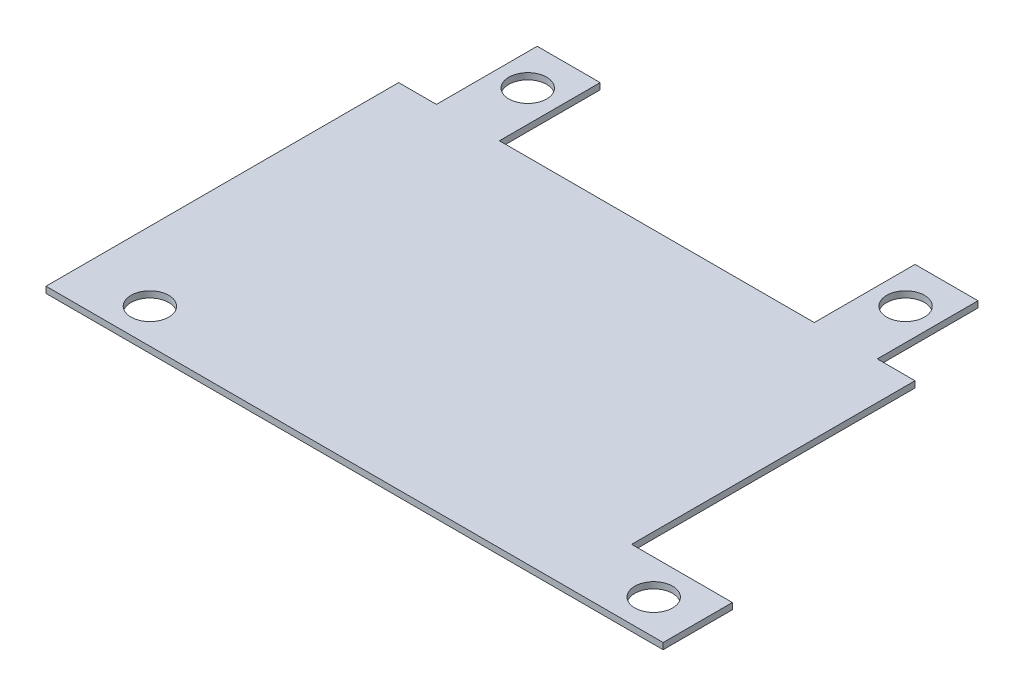
ISO-10303-21;
HEADER;
FILE_DESCRIPTION(('STEP AP214'),'2;1');
FILE_NAME('part.step','',(''),(''),'','','');
FILE_SCHEMA(('AUTOMOTIVE_DESIGN { 1 0 10303 214 1 1 1 1 }'));
ENDSEC;
DATA;
#1=APPLICATION_CONTEXT('core data for automotive mechanical design processes');
#2=APPLICATION_PROTOCOL_DEFINITION('international standard','automotive_design',2000,#1);
#3=PRODUCT_CONTEXT('',#1,'mechanical');
#4=PRODUCT('Part','Part','',(#3));
#5=PRODUCT_RELATED_PRODUCT_CATEGORY('part','',(#4));
#6=PRODUCT_DEFINITION_FORMATION('','',#4);
#7=PRODUCT_DEFINITION_CONTEXT('part definition',#1,'design');
#8=PRODUCT_DEFINITION('design','',#6,#7);
#9=PRODUCT_DEFINITION_SHAPE('','',#8);
#10=(LENGTH_UNIT() NAMED_UNIT(*) SI_UNIT(.MILLI.,.METRE.));
#11=(NAMED_UNIT(*) PLANE_ANGLE_UNIT() SI_UNIT($,.RADIAN.));
#12=(NAMED_UNIT(*) SI_UNIT($,.STERADIAN.) SOLID_ANGLE_UNIT());
#13=UNCERTAINTY_MEASURE_WITH_UNIT(LENGTH_MEASURE(1.E-05),#10,'distance_accuracy_value','');
#14=(GEOMETRIC_REPRESENTATION_CONTEXT(3) GLOBAL_UNCERTAINTY_ASSIGNED_CONTEXT((#13)) GLOBAL_UNIT_ASSIGNED_CONTEXT((#10,
#11,#12)) REPRESENTATION_CONTEXT('',''));
#15=CARTESIAN_POINT('',(0.,0.,0.));
#16=DIRECTION('',(0.,0.,1.));
#17=DIRECTION('',(1.,0.,0.));
#18=AXIS2_PLACEMENT_3D('',#15,#16,#17);
#19=CARTESIAN_POINT('',(20.5,0.5,-14.));
#20=DIRECTION('',(0.,0.,1.));
#21=DIRECTION('',(1.,0.,0.));
#22=AXIS2_PLACEMENT_3D('',#19,#20,#21);
#23=PLANE('',#22);
#24=DIRECTION('',(0.,-1.,0.));
#25=VECTOR('',#24,1.);
#26=CARTESIAN_POINT('',(12.5,10.2082439194738,-14.));
#27=LINE('',#26,#25);
#28=CARTESIAN_POINT('',(12.5,0.5,-14.));
#29=VERTEX_POINT('',#28);
#30=CARTESIAN_POINT('',(12.5,0.,-14.));
#31=VERTEX_POINT('',#30);
#32=EDGE_CURVE('E188',#29,#31,#27,.T.);
#33=ORIENTED_EDGE('',*,*,#32,.T.);
#34=DIRECTION('',(-1.,0.,0.));
#35=VECTOR('',#34,1.);
#36=CARTESIAN_POINT('',(20.5,0.,-14.));
#37=LINE('',#36,#35);
#38=CARTESIAN_POINT('',(-12.5,0.,-14.));
#39=VERTEX_POINT('',#38);
#40=EDGE_CURVE('E247',#31,#39,#37,.T.);
#41=ORIENTED_EDGE('',*,*,#40,.T.);
#42=DIRECTION('',(0.,-1.,0.));
#43=VECTOR('',#42,1.);
#44=CARTESIAN_POINT('',(-12.5,10.2082439194738,-14.));
#45=LINE('',#44,#43);
#46=CARTESIAN_POINT('',(-12.5,0.5,-14.));
#47=VERTEX_POINT('',#46);
#48=EDGE_CURVE('E234',#47,#39,#45,.T.);
#49=ORIENTED_EDGE('',*,*,#48,.F.);
#50=DIRECTION('',(-1.,0.,0.));
#51=VECTOR('',#50,1.);
#52=CARTESIAN_POINT('',(20.5,0.5,-14.));
#53=LINE('',#52,#51);
#54=EDGE_CURVE('E60',#29,#47,#53,.T.);
#55=ORIENTED_EDGE('',*,*,#54,.F.);
#56=EDGE_LOOP('',(#33,#41,#49,#55));
#57=FACE_BOUND('',#56,.T.);
#58=ADVANCED_FACE('F35',(#57),#23,.F.);
#59=DIRECTION('',(0.,-1.,0.));
#60=VECTOR('',#59,1.);
#61=CARTESIAN_POINT('',(17.5,10.2082439194738,-14.));
#62=LINE('',#61,#60);
#63=CARTESIAN_POINT('',(17.5,0.5,-14.));
#64=VERTEX_POINT('',#63);
#65=CARTESIAN_POINT('',(17.5,0.,-14.));
#66=VERTEX_POINT('',#65);
#67=EDGE_CURVE('E184',#64,#66,#62,.T.);
#68=ORIENTED_EDGE('',*,*,#67,.F.);
#69=CARTESIAN_POINT('',(20.5,0.5,-14.));
#70=VERTEX_POINT('',#69);
#71=EDGE_CURVE('E272',#70,#64,#53,.T.);
#72=ORIENTED_EDGE('',*,*,#71,.F.);
#73=DIRECTION('',(0.,-1.,0.));
#74=VECTOR('',#73,1.);
#75=CARTESIAN_POINT('',(20.5,0.5,-14.));
#76=LINE('',#75,#74);
#77=CARTESIAN_POINT('',(20.5,0.,-14.));
#78=VERTEX_POINT('',#77);
#79=EDGE_CURVE('E44',#70,#78,#76,.T.);
#80=ORIENTED_EDGE('',*,*,#79,.T.);
#81=EDGE_CURVE('E250',#78,#66,#37,.T.);
#82=ORIENTED_EDGE('',*,*,#81,.T.);
#83=EDGE_LOOP('',(#68,#72,#80,#82));
#84=FACE_BOUND('',#83,.T.);
#85=ADVANCED_FACE('F357',(#84),#23,.F.);
#86=CARTESIAN_POINT('',(-20.5,0.5,-14.));
#87=DIRECTION('',(1.,0.,0.));
#88=DIRECTION('',(0.,0.,-1.));
#89=AXIS2_PLACEMENT_3D('',#86,#87,#88);
#90=PLANE('',#89);
#91=DIRECTION('',(0.,0.,1.));
#92=VECTOR('',#91,1.);
#93=CARTESIAN_POINT('',(-20.5,0.,-14.));
#94=LINE('',#93,#92);
#95=CARTESIAN_POINT('',(-20.5,0.,-14.));
#96=VERTEX_POINT('',#95);
#97=CARTESIAN_POINT('',(-20.5,0.,14.));
#98=VERTEX_POINT('',#97);
#99=EDGE_CURVE('E284',#96,#98,#94,.T.);
#100=ORIENTED_EDGE('',*,*,#99,.T.);
#101=DIRECTION('',(0.,-1.,0.));
#102=VECTOR('',#101,1.);
#103=CARTESIAN_POINT('',(-20.5,0.5,14.));
#104=LINE('',#103,#102);
#105=CARTESIAN_POINT('',(-20.5,0.5,14.));
#106=VERTEX_POINT('',#105);
#107=EDGE_CURVE('E11',#106,#98,#104,.T.);
#108=ORIENTED_EDGE('',*,*,#107,.F.);
#109=DIRECTION('',(0.,0.,1.));
#110=VECTOR('',#109,1.);
#111=CARTESIAN_POINT('',(-20.5,0.5,-14.));
#112=LINE('',#111,#110);
#113=CARTESIAN_POINT('',(-20.5,0.5,-14.));
#114=VERTEX_POINT('',#113);
#115=EDGE_CURVE('E146',#114,#106,#112,.T.);
#116=ORIENTED_EDGE('',*,*,#115,.F.);
#117=DIRECTION('',(0.,-1.,0.));
#118=VECTOR('',#117,1.);
#119=CARTESIAN_POINT('',(-20.5,0.5,-14.));
#120=LINE('',#119,#118);
#121=EDGE_CURVE('E259',#114,#96,#120,.T.);
#122=ORIENTED_EDGE('',*,*,#121,.T.);
#123=EDGE_LOOP('',(#100,#108,#116,#122));
#124=FACE_BOUND('',#123,.T.);
#125=ADVANCED_FACE('F37',(#124),#90,.F.);
#126=CARTESIAN_POINT('',(20.5,0.5,14.));
#127=DIRECTION('',(0.,0.,-1.));
#128=DIRECTION('',(-1.,0.,0.));
#129=AXIS2_PLACEMENT_3D('',#126,#127,#128);
#130=PLANE('',#129);
#131=DIRECTION('',(1.,0.,0.));
#132=VECTOR('',#131,1.);
#133=CARTESIAN_POINT('',(20.5,0.,14.));
#134=LINE('',#133,#132);
#135=CARTESIAN_POINT('',(28.5,0.,14.));
#136=VERTEX_POINT('',#135);
#137=EDGE_CURVE('E154',#98,#136,#134,.T.);
#138=ORIENTED_EDGE('',*,*,#137,.T.);
#139=DIRECTION('',(0.,-1.,0.));
#140=VECTOR('',#139,1.);
#141=CARTESIAN_POINT('',(28.5,10.2082439194738,14.));
#142=LINE('',#141,#140);
#143=CARTESIAN_POINT('',(28.5,0.5,14.));
#144=VERTEX_POINT('',#143);
#145=EDGE_CURVE('E152',#144,#136,#142,.T.);
#146=ORIENTED_EDGE('',*,*,#145,.F.);
#147=DIRECTION('',(1.,0.,0.));
#148=VECTOR('',#147,1.);
#149=CARTESIAN_POINT('',(20.5,0.5,14.));
#150=LINE('',#149,#148);
#151=EDGE_CURVE('E139',#106,#144,#150,.T.);
#152=ORIENTED_EDGE('',*,*,#151,.F.);
#153=ORIENTED_EDGE('',*,*,#107,.T.);
#154=EDGE_LOOP('',(#138,#146,#152,#153));
#155=FACE_BOUND('',#154,.T.);
#156=ADVANCED_FACE('F153',(#155),#130,.F.);
#157=CARTESIAN_POINT('',(20.5,0.5,-14.));
#158=DIRECTION('',(-1.,0.,0.));
#159=DIRECTION('',(0.,0.,1.));
#160=AXIS2_PLACEMENT_3D('',#157,#158,#159);
#161=PLANE('',#160);
#162=DIRECTION('',(0.,0.,-1.));
#163=VECTOR('',#162,1.);
#164=CARTESIAN_POINT('',(20.5,0.5,-14.));
#165=LINE('',#164,#163);
#166=CARTESIAN_POINT('',(20.5,0.5,8.50000000000001));
#167=VERTEX_POINT('',#166);
#168=EDGE_CURVE('E149',#167,#70,#165,.T.);
#169=ORIENTED_EDGE('',*,*,#168,.F.);
#170=DIRECTION('',(0.,-1.,0.));
#171=VECTOR('',#170,1.);
#172=CARTESIAN_POINT('',(20.5,10.2082439194738,8.50000000000001));
#173=LINE('',#172,#171);
#174=CARTESIAN_POINT('',(20.5,0.,8.50000000000001));
#175=VERTEX_POINT('',#174);
#176=EDGE_CURVE('E163',#167,#175,#173,.T.);
#177=ORIENTED_EDGE('',*,*,#176,.T.);
#178=DIRECTION('',(0.,0.,-1.));
#179=VECTOR('',#178,1.);
#180=CARTESIAN_POINT('',(20.5,0.,-14.));
#181=LINE('',#180,#179);
#182=EDGE_CURVE('E287',#175,#78,#181,.T.);
#183=ORIENTED_EDGE('',*,*,#182,.T.);
#184=ORIENTED_EDGE('',*,*,#79,.F.);
#185=EDGE_LOOP('',(#169,#177,#183,#184));
#186=FACE_BOUND('',#185,.T.);
#187=ADVANCED_FACE('F367',(#186),#161,.F.);
#188=CARTESIAN_POINT('',(-17.5,0.5,-14.));
#189=VERTEX_POINT('',#188);
#190=EDGE_CURVE('E278',#189,#114,#53,.T.);
#191=ORIENTED_EDGE('',*,*,#190,.F.);
#192=DIRECTION('',(0.,-1.,0.));
#193=VECTOR('',#192,1.);
#194=CARTESIAN_POINT('',(-17.5,10.2082439194738,-14.));
#195=LINE('',#194,#193);
#196=CARTESIAN_POINT('',(-17.5,0.,-14.));
#197=VERTEX_POINT('',#196);
#198=EDGE_CURVE('E221',#189,#197,#195,.T.);
#199=ORIENTED_EDGE('',*,*,#198,.T.);
#200=EDGE_CURVE('E251',#197,#96,#37,.T.);
#201=ORIENTED_EDGE('',*,*,#200,.T.);
#202=ORIENTED_EDGE('',*,*,#121,.F.);
#203=EDGE_LOOP('',(#191,#199,#201,#202));
#204=FACE_BOUND('',#203,.T.);
#205=ADVANCED_FACE('F315',(#204),#23,.F.);
#206=CARTESIAN_POINT('',(0.,0.5,0.));
#207=DIRECTION('',(0.,-1.,0.));
#208=DIRECTION('',(0.,0.,-1.));
#209=AXIS2_PLACEMENT_3D('',#206,#207,#208);
#210=PLANE('',#209);
#211=CARTESIAN_POINT('',(-15.,0.5,11.25));
#212=DIRECTION('',(0.,1.,0.));
#213=DIRECTION('',(0.,0.,1.));
#214=AXIS2_PLACEMENT_3D('',#211,#212,#213);
#215=CIRCLE('',#214,1.5);
#216=CARTESIAN_POINT('',(-15.,0.5,12.75));
#217=VERTEX_POINT('',#216);
#218=EDGE_CURVE('E300',#217,#217,#215,.T.);
#219=ORIENTED_EDGE('',*,*,#218,.F.);
#220=EDGE_LOOP('',(#219));
#221=FACE_BOUND('',#220,.T.);
#222=CARTESIAN_POINT('',(25.,0.5,11.25));
#223=DIRECTION('',(0.,-1.,0.));
#224=DIRECTION('',(0.,0.,-1.));
#225=AXIS2_PLACEMENT_3D('',#222,#223,#224);
#226=CIRCLE('',#225,1.5);
#227=CARTESIAN_POINT('',(25.,0.5,9.75));
#228=VERTEX_POINT('',#227);
#229=EDGE_CURVE('E171',#228,#228,#226,.T.);
#230=ORIENTED_EDGE('',*,*,#229,.T.);
#231=EDGE_LOOP('',(#230));
#232=FACE_BOUND('',#231,.T.);
#233=CARTESIAN_POINT('',(15.,0.5,-18.75));
#234=DIRECTION('',(0.,-1.,0.));
#235=DIRECTION('',(0.,0.,-1.));
#236=AXIS2_PLACEMENT_3D('',#233,#234,#235);
#237=CIRCLE('',#236,1.5);
#238=CARTESIAN_POINT('',(15.,0.5,-20.25));
#239=VERTEX_POINT('',#238);
#240=EDGE_CURVE('E178',#239,#239,#237,.T.);
#241=ORIENTED_EDGE('',*,*,#240,.T.);
#242=EDGE_LOOP('',(#241));
#243=FACE_BOUND('',#242,.T.);
#244=CARTESIAN_POINT('',(-15.,0.5,-18.75));
#245=DIRECTION('',(0.,-1.,0.));
#246=DIRECTION('',(0.,0.,-1.));
#247=AXIS2_PLACEMENT_3D('',#244,#245,#246);
#248=CIRCLE('',#247,1.5);
#249=CARTESIAN_POINT('',(-15.,0.5,-20.25));
#250=VERTEX_POINT('',#249);
#251=EDGE_CURVE('E211',#250,#250,#248,.T.);
#252=ORIENTED_EDGE('',*,*,#251,.T.);
#253=EDGE_LOOP('',(#252));
#254=FACE_BOUND('',#253,.T.);
#255=ORIENTED_EDGE('',*,*,#115,.T.);
#256=ORIENTED_EDGE('',*,*,#151,.T.);
#257=DIRECTION('',(0.,0.,1.));
#258=VECTOR('',#257,1.);
#259=CARTESIAN_POINT('',(28.5,0.5,14.));
#260=LINE('',#259,#258);
#261=CARTESIAN_POINT('',(28.5,0.5,8.50000000000001));
#262=VERTEX_POINT('',#261);
#263=EDGE_CURVE('E143',#262,#144,#260,.T.);
#264=ORIENTED_EDGE('',*,*,#263,.F.);
#265=DIRECTION('',(1.,0.,0.));
#266=VECTOR('',#265,1.);
#267=CARTESIAN_POINT('',(20.5,0.5,8.50000000000001));
#268=LINE('',#267,#266);
#269=EDGE_CURVE('E295',#167,#262,#268,.T.);
#270=ORIENTED_EDGE('',*,*,#269,.F.);
#271=ORIENTED_EDGE('',*,*,#168,.T.);
#272=ORIENTED_EDGE('',*,*,#71,.T.);
#273=DIRECTION('',(0.,0.,1.));
#274=VECTOR('',#273,1.);
#275=CARTESIAN_POINT('',(17.5,0.5,-14.));
#276=LINE('',#275,#274);
#277=CARTESIAN_POINT('',(17.5,0.5,-22.));
#278=VERTEX_POINT('',#277);
#279=EDGE_CURVE('E194',#278,#64,#276,.T.);
#280=ORIENTED_EDGE('',*,*,#279,.F.);
#281=DIRECTION('',(1.,0.,0.));
#282=VECTOR('',#281,1.);
#283=CARTESIAN_POINT('',(12.5,0.5,-22.));
#284=LINE('',#283,#282);
#285=CARTESIAN_POINT('',(12.5,0.5,-22.));
#286=VERTEX_POINT('',#285);
#287=EDGE_CURVE('E183',#286,#278,#284,.T.);
#288=ORIENTED_EDGE('',*,*,#287,.F.);
#289=DIRECTION('',(0.,0.,-1.));
#290=VECTOR('',#289,1.);
#291=CARTESIAN_POINT('',(12.5,0.5,-14.));
#292=LINE('',#291,#290);
#293=EDGE_CURVE('E192',#29,#286,#292,.T.);
#294=ORIENTED_EDGE('',*,*,#293,.F.);
#295=ORIENTED_EDGE('',*,*,#54,.T.);
#296=DIRECTION('',(0.,0.,1.));
#297=VECTOR('',#296,1.);
#298=CARTESIAN_POINT('',(-12.5,0.5,-14.));
#299=LINE('',#298,#297);
#300=CARTESIAN_POINT('',(-12.5,0.5,-22.));
#301=VERTEX_POINT('',#300);
#302=EDGE_CURVE('E225',#301,#47,#299,.T.);
#303=ORIENTED_EDGE('',*,*,#302,.F.);
#304=DIRECTION('',(1.,0.,0.));
#305=VECTOR('',#304,1.);
#306=CARTESIAN_POINT('',(-17.5,0.5,-22.));
#307=LINE('',#306,#305);
#308=CARTESIAN_POINT('',(-17.5,0.5,-22.));
#309=VERTEX_POINT('',#308);
#310=EDGE_CURVE('E244',#309,#301,#307,.T.);
#311=ORIENTED_EDGE('',*,*,#310,.F.);
#312=DIRECTION('',(0.,0.,-1.));
#313=VECTOR('',#312,1.);
#314=CARTESIAN_POINT('',(-17.5,0.5,-14.));
#315=LINE('',#314,#313);
#316=EDGE_CURVE('E215',#189,#309,#315,.T.);
#317=ORIENTED_EDGE('',*,*,#316,.F.);
#318=ORIENTED_EDGE('',*,*,#190,.T.);
#319=EDGE_LOOP('',(#255,#256,#264,#270,#271,#272,#280,#288,#294,#295,#303,#311,#317,#318));
#320=FACE_BOUND('',#319,.T.);
#321=ADVANCED_FACE('F141',(#221,#232,#243,#254,#320),#210,.F.);
#322=CARTESIAN_POINT('',(0.,0.,0.));
#323=DIRECTION('',(0.,-1.,0.));
#324=DIRECTION('',(0.,0.,-1.));
#325=AXIS2_PLACEMENT_3D('',#322,#323,#324);
#326=PLANE('',#325);
#327=CARTESIAN_POINT('',(-15.,0.,11.25));
#328=DIRECTION('',(0.,-1.,0.));
#329=DIRECTION('',(0.,0.,-1.));
#330=AXIS2_PLACEMENT_3D('',#327,#328,#329);
#331=CIRCLE('',#330,1.5);
#332=CARTESIAN_POINT('',(-15.,0.,9.75000000000001));
#333=VERTEX_POINT('',#332);
#334=EDGE_CURVE('E39',#333,#333,#331,.T.);
#335=ORIENTED_EDGE('',*,*,#334,.F.);
#336=EDGE_LOOP('',(#335));
#337=FACE_BOUND('',#336,.T.);
#338=CARTESIAN_POINT('',(25.,0.,11.25));
#339=DIRECTION('',(0.,1.,0.));
#340=DIRECTION('',(0.,0.,1.));
#341=AXIS2_PLACEMENT_3D('',#338,#339,#340);
#342=CIRCLE('',#341,1.5);
#343=CARTESIAN_POINT('',(25.,0.,12.75));
#344=VERTEX_POINT('',#343);
#345=EDGE_CURVE('E165',#344,#344,#342,.T.);
#346=ORIENTED_EDGE('',*,*,#345,.T.);
#347=EDGE_LOOP('',(#346));
#348=FACE_BOUND('',#347,.T.);
#349=CARTESIAN_POINT('',(15.,0.,-18.75));
#350=DIRECTION('',(0.,1.,0.));
#351=DIRECTION('',(0.,0.,1.));
#352=AXIS2_PLACEMENT_3D('',#349,#350,#351);
#353=CIRCLE('',#352,1.5);
#354=CARTESIAN_POINT('',(15.,0.,-17.25));
#355=VERTEX_POINT('',#354);
#356=EDGE_CURVE('E174',#355,#355,#353,.T.);
#357=ORIENTED_EDGE('',*,*,#356,.T.);
#358=EDGE_LOOP('',(#357));
#359=FACE_BOUND('',#358,.T.);
#360=CARTESIAN_POINT('',(-15.,0.,-18.75));
#361=DIRECTION('',(0.,1.,0.));
#362=DIRECTION('',(0.,0.,1.));
#363=AXIS2_PLACEMENT_3D('',#360,#361,#362);
#364=CIRCLE('',#363,1.5);
#365=CARTESIAN_POINT('',(-15.,0.,-17.25));
#366=VERTEX_POINT('',#365);
#367=EDGE_CURVE('E207',#366,#366,#364,.T.);
#368=ORIENTED_EDGE('',*,*,#367,.T.);
#369=EDGE_LOOP('',(#368));
#370=FACE_BOUND('',#369,.T.);
#371=ORIENTED_EDGE('',*,*,#99,.F.);
#372=ORIENTED_EDGE('',*,*,#200,.F.);
#373=DIRECTION('',(0.,0.,1.));
#374=VECTOR('',#373,1.);
#375=CARTESIAN_POINT('',(-17.5,0.,-14.));
#376=LINE('',#375,#374);
#377=CARTESIAN_POINT('',(-17.5,0.,-22.));
#378=VERTEX_POINT('',#377);
#379=EDGE_CURVE('E226',#378,#197,#376,.T.);
#380=ORIENTED_EDGE('',*,*,#379,.F.);
#381=DIRECTION('',(-1.,0.,0.));
#382=VECTOR('',#381,1.);
#383=CARTESIAN_POINT('',(-17.5,0.,-22.));
#384=LINE('',#383,#382);
#385=CARTESIAN_POINT('',(-12.5,0.,-22.));
#386=VERTEX_POINT('',#385);
#387=EDGE_CURVE('E208',#386,#378,#384,.T.);
#388=ORIENTED_EDGE('',*,*,#387,.F.);
#389=DIRECTION('',(0.,0.,-1.));
#390=VECTOR('',#389,1.);
#391=CARTESIAN_POINT('',(-12.5,0.,-14.));
#392=LINE('',#391,#390);
#393=EDGE_CURVE('E237',#39,#386,#392,.T.);
#394=ORIENTED_EDGE('',*,*,#393,.F.);
#395=ORIENTED_EDGE('',*,*,#40,.F.);
#396=DIRECTION('',(0.,0.,1.));
#397=VECTOR('',#396,1.);
#398=CARTESIAN_POINT('',(12.5,0.,-14.));
#399=LINE('',#398,#397);
#400=CARTESIAN_POINT('',(12.5,0.,-22.));
#401=VERTEX_POINT('',#400);
#402=EDGE_CURVE('E185',#401,#31,#399,.T.);
#403=ORIENTED_EDGE('',*,*,#402,.F.);
#404=DIRECTION('',(-1.,0.,0.));
#405=VECTOR('',#404,1.);
#406=CARTESIAN_POINT('',(12.5,0.,-22.));
#407=LINE('',#406,#405);
#408=CARTESIAN_POINT('',(17.5,0.,-22.));
#409=VERTEX_POINT('',#408);
#410=EDGE_CURVE('E175',#409,#401,#407,.T.);
#411=ORIENTED_EDGE('',*,*,#410,.F.);
#412=DIRECTION('',(0.,0.,-1.));
#413=VECTOR('',#412,1.);
#414=CARTESIAN_POINT('',(17.5,0.,-14.));
#415=LINE('',#414,#413);
#416=EDGE_CURVE('E180',#66,#409,#415,.T.);
#417=ORIENTED_EDGE('',*,*,#416,.F.);
#418=ORIENTED_EDGE('',*,*,#81,.F.);
#419=ORIENTED_EDGE('',*,*,#182,.F.);
#420=DIRECTION('',(-1.,0.,0.));
#421=VECTOR('',#420,1.);
#422=CARTESIAN_POINT('',(20.5,0.,8.50000000000001));
#423=LINE('',#422,#421);
#424=CARTESIAN_POINT('',(28.5,0.,8.50000000000001));
#425=VERTEX_POINT('',#424);
#426=EDGE_CURVE('E52',#425,#175,#423,.T.);
#427=ORIENTED_EDGE('',*,*,#426,.F.);
#428=DIRECTION('',(0.,0.,-1.));
#429=VECTOR('',#428,1.);
#430=CARTESIAN_POINT('',(28.5,0.,14.));
#431=LINE('',#430,#429);
#432=EDGE_CURVE('E158',#136,#425,#431,.T.);
#433=ORIENTED_EDGE('',*,*,#432,.F.);
#434=ORIENTED_EDGE('',*,*,#137,.F.);
#435=EDGE_LOOP('',(#371,#372,#380,#388,#394,#395,#403,#411,#417,#418,#419,#427,#433,#434));
#436=FACE_BOUND('',#435,.T.);
#437=ADVANCED_FACE('F314',(#337,#348,#359,#370,#436),#326,.T.);
#438=CARTESIAN_POINT('',(-17.5,10.2082439194738,-14.));
#439=DIRECTION('',(1.,0.,0.));
#440=DIRECTION('',(0.,0.,-1.));
#441=AXIS2_PLACEMENT_3D('',#438,#439,#440);
#442=PLANE('',#441);
#443=ORIENTED_EDGE('',*,*,#198,.F.);
#444=ORIENTED_EDGE('',*,*,#316,.T.);
#445=DIRECTION('',(0.,-1.,0.));
#446=VECTOR('',#445,1.);
#447=CARTESIAN_POINT('',(-17.5,10.2082439194738,-22.));
#448=LINE('',#447,#446);
#449=EDGE_CURVE('E231',#309,#378,#448,.T.);
#450=ORIENTED_EDGE('',*,*,#449,.T.);
#451=ORIENTED_EDGE('',*,*,#379,.T.);
#452=EDGE_LOOP('',(#443,#444,#450,#451));
#453=FACE_BOUND('',#452,.T.);
#454=ADVANCED_FACE('F342',(#453),#442,.F.);
#455=CARTESIAN_POINT('',(-12.5,10.2082439194738,-14.));
#456=DIRECTION('',(-1.,0.,0.));
#457=DIRECTION('',(0.,0.,1.));
#458=AXIS2_PLACEMENT_3D('',#455,#456,#457);
#459=PLANE('',#458);
#460=DIRECTION('',(0.,-1.,0.));
#461=VECTOR('',#460,1.);
#462=CARTESIAN_POINT('',(-12.5,10.2082439194738,-22.));
#463=LINE('',#462,#461);
#464=EDGE_CURVE('E212',#301,#386,#463,.T.);
#465=ORIENTED_EDGE('',*,*,#464,.F.);
#466=ORIENTED_EDGE('',*,*,#302,.T.);
#467=ORIENTED_EDGE('',*,*,#48,.T.);
#468=ORIENTED_EDGE('',*,*,#393,.T.);
#469=EDGE_LOOP('',(#465,#466,#467,#468));
#470=FACE_BOUND('',#469,.T.);
#471=ADVANCED_FACE('F337',(#470),#459,.F.);
#472=CARTESIAN_POINT('',(-17.5,10.2082439194738,-22.));
#473=DIRECTION('',(0.,0.,1.));
#474=DIRECTION('',(1.,0.,0.));
#475=AXIS2_PLACEMENT_3D('',#472,#473,#474);
#476=PLANE('',#475);
#477=ORIENTED_EDGE('',*,*,#449,.F.);
#478=ORIENTED_EDGE('',*,*,#310,.T.);
#479=ORIENTED_EDGE('',*,*,#464,.T.);
#480=ORIENTED_EDGE('',*,*,#387,.T.);
#481=EDGE_LOOP('',(#477,#478,#479,#480));
#482=FACE_BOUND('',#481,.T.);
#483=ADVANCED_FACE('F332',(#482),#476,.F.);
#484=CARTESIAN_POINT('',(-15.,10.2082439194738,-18.75));
#485=DIRECTION('',(0.,-1.,0.));
#486=DIRECTION('',(0.,0.,-1.));
#487=AXIS2_PLACEMENT_3D('',#484,#485,#486);
#488=CYLINDRICAL_SURFACE('',#487,1.5);
#489=ORIENTED_EDGE('',*,*,#251,.F.);
#490=EDGE_LOOP('',(#489));
#491=FACE_BOUND('',#490,.T.);
#492=ORIENTED_EDGE('',*,*,#367,.F.);
#493=EDGE_LOOP('',(#492));
#494=FACE_BOUND('',#493,.T.);
#495=ADVANCED_FACE('F395',(#491,#494),#488,.F.);
#496=CARTESIAN_POINT('',(12.5,10.2082439194738,-14.));
#497=DIRECTION('',(1.,0.,0.));
#498=DIRECTION('',(0.,0.,-1.));
#499=AXIS2_PLACEMENT_3D('',#496,#497,#498);
#500=PLANE('',#499);
#501=ORIENTED_EDGE('',*,*,#32,.F.);
#502=ORIENTED_EDGE('',*,*,#293,.T.);
#503=DIRECTION('',(0.,-1.,0.));
#504=VECTOR('',#503,1.);
#505=CARTESIAN_POINT('',(12.5,10.2082439194738,-22.));
#506=LINE('',#505,#504);
#507=EDGE_CURVE('E189',#286,#401,#506,.T.);
#508=ORIENTED_EDGE('',*,*,#507,.T.);
#509=ORIENTED_EDGE('',*,*,#402,.T.);
#510=EDGE_LOOP('',(#501,#502,#508,#509));
#511=FACE_BOUND('',#510,.T.);
#512=ADVANCED_FACE('F350',(#511),#500,.F.);
#513=CARTESIAN_POINT('',(17.5,10.2082439194738,-14.));
#514=DIRECTION('',(-1.,0.,0.));
#515=DIRECTION('',(0.,0.,1.));
#516=AXIS2_PLACEMENT_3D('',#513,#514,#515);
#517=PLANE('',#516);
#518=DIRECTION('',(0.,-1.,0.));
#519=VECTOR('',#518,1.);
#520=CARTESIAN_POINT('',(17.5,10.2082439194738,-22.));
#521=LINE('',#520,#519);
#522=EDGE_CURVE('E179',#278,#409,#521,.T.);
#523=ORIENTED_EDGE('',*,*,#522,.F.);
#524=ORIENTED_EDGE('',*,*,#279,.T.);
#525=ORIENTED_EDGE('',*,*,#67,.T.);
#526=ORIENTED_EDGE('',*,*,#416,.T.);
#527=EDGE_LOOP('',(#523,#524,#525,#526));
#528=FACE_BOUND('',#527,.T.);
#529=ADVANCED_FACE('F356',(#528),#517,.F.);
#530=CARTESIAN_POINT('',(12.5,10.2082439194738,-22.));
#531=DIRECTION('',(0.,0.,1.));
#532=DIRECTION('',(1.,0.,0.));
#533=AXIS2_PLACEMENT_3D('',#530,#531,#532);
#534=PLANE('',#533);
#535=ORIENTED_EDGE('',*,*,#507,.F.);
#536=ORIENTED_EDGE('',*,*,#287,.T.);
#537=ORIENTED_EDGE('',*,*,#522,.T.);
#538=ORIENTED_EDGE('',*,*,#410,.T.);
#539=EDGE_LOOP('',(#535,#536,#537,#538));
#540=FACE_BOUND('',#539,.T.);
#541=ADVANCED_FACE('F353',(#540),#534,.F.);
#542=CARTESIAN_POINT('',(15.,10.2082439194738,-18.75));
#543=DIRECTION('',(0.,-1.,0.));
#544=DIRECTION('',(0.,0.,-1.));
#545=AXIS2_PLACEMENT_3D('',#542,#543,#544);
#546=CYLINDRICAL_SURFACE('',#545,1.5);
#547=ORIENTED_EDGE('',*,*,#240,.F.);
#548=EDGE_LOOP('',(#547));
#549=FACE_BOUND('',#548,.T.);
#550=ORIENTED_EDGE('',*,*,#356,.F.);
#551=EDGE_LOOP('',(#550));
#552=FACE_BOUND('',#551,.T.);
#553=ADVANCED_FACE('F385',(#549,#552),#546,.F.);
#554=CARTESIAN_POINT('',(28.5,10.2082439194738,14.));
#555=DIRECTION('',(-1.,0.,0.));
#556=DIRECTION('',(0.,0.,1.));
#557=AXIS2_PLACEMENT_3D('',#554,#555,#556);
#558=PLANE('',#557);
#559=DIRECTION('',(0.,-1.,0.));
#560=VECTOR('',#559,1.);
#561=CARTESIAN_POINT('',(28.5,10.2082439194738,8.50000000000001));
#562=LINE('',#561,#560);
#563=EDGE_CURVE('E161',#262,#425,#562,.T.);
#564=ORIENTED_EDGE('',*,*,#563,.F.);
#565=ORIENTED_EDGE('',*,*,#263,.T.);
#566=ORIENTED_EDGE('',*,*,#145,.T.);
#567=ORIENTED_EDGE('',*,*,#432,.T.);
#568=EDGE_LOOP('',(#564,#565,#566,#567));
#569=FACE_BOUND('',#568,.T.);
#570=ADVANCED_FACE('F160',(#569),#558,.F.);
#571=CARTESIAN_POINT('',(20.5,10.2082439194738,8.50000000000001));
#572=DIRECTION('',(0.,0.,1.));
#573=DIRECTION('',(1.,0.,0.));
#574=AXIS2_PLACEMENT_3D('',#571,#572,#573);
#575=PLANE('',#574);
#576=ORIENTED_EDGE('',*,*,#176,.F.);
#577=ORIENTED_EDGE('',*,*,#269,.T.);
#578=ORIENTED_EDGE('',*,*,#563,.T.);
#579=ORIENTED_EDGE('',*,*,#426,.T.);
#580=EDGE_LOOP('',(#576,#577,#578,#579));
#581=FACE_BOUND('',#580,.T.);
#582=ADVANCED_FACE('F375',(#581),#575,.F.);
#583=CARTESIAN_POINT('',(25.,10.2082439194738,11.25));
#584=DIRECTION('',(0.,-1.,0.));
#585=DIRECTION('',(0.,0.,-1.));
#586=AXIS2_PLACEMENT_3D('',#583,#584,#585);
#587=CYLINDRICAL_SURFACE('',#586,1.5);
#588=ORIENTED_EDGE('',*,*,#229,.F.);
#589=EDGE_LOOP('',(#588));
#590=FACE_BOUND('',#589,.T.);
#591=ORIENTED_EDGE('',*,*,#345,.F.);
#592=EDGE_LOOP('',(#591));
#593=FACE_BOUND('',#592,.T.);
#594=ADVANCED_FACE('F377',(#590,#593),#587,.F.);
#595=CARTESIAN_POINT('',(-15.,-5.00000000000283E-05,11.25));
#596=DIRECTION('',(0.,1.,0.));
#597=DIRECTION('',(0.,0.,1.));
#598=AXIS2_PLACEMENT_3D('',#595,#596,#597);
#599=CYLINDRICAL_SURFACE('',#598,1.5);
#600=ORIENTED_EDGE('',*,*,#334,.T.);
#601=EDGE_LOOP('',(#600));
#602=FACE_BOUND('',#601,.T.);
#603=ORIENTED_EDGE('',*,*,#218,.T.);
#604=EDGE_LOOP('',(#603));
#605=FACE_BOUND('',#604,.T.);
#606=ADVANCED_FACE('F310',(#602,#605),#599,.F.);
#607=CLOSED_SHELL('',(#58,#85,#125,#156,#187,#205,#321,#437,#454,#471,#483,#495,#512,#529,#541,
#553,#570,#582,#594,#606));
#608=MANIFOLD_SOLID_BREP('B2',#607);
#609=ADVANCED_BREP_SHAPE_REPRESENTATION('',(#18,#608),#14);
#610=SHAPE_DEFINITION_REPRESENTATION(#9,#609);
ENDSEC;
END-ISO-10303-21;
